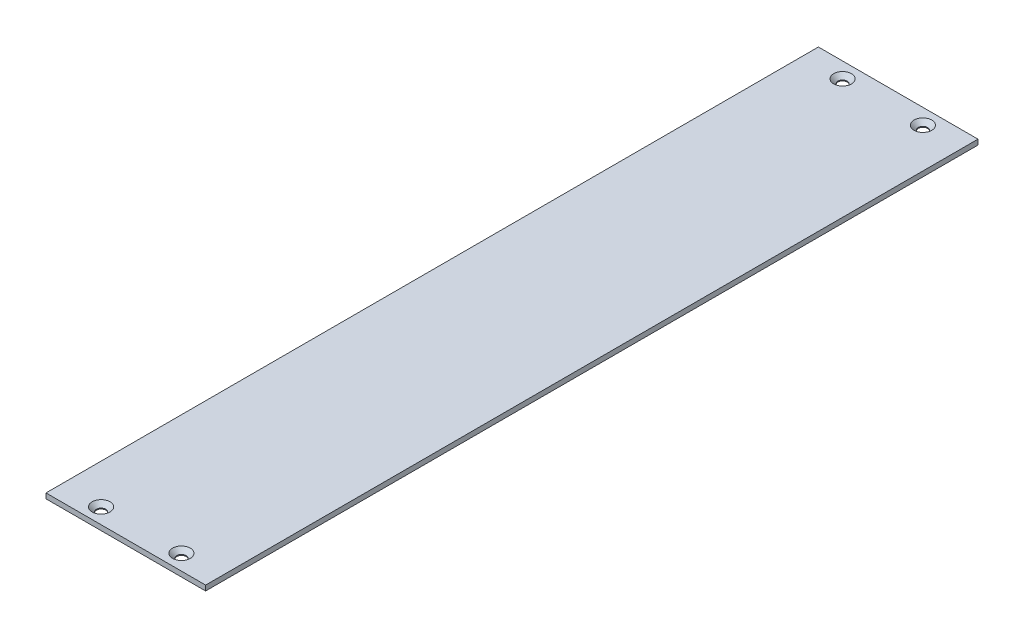
ISO-10303-21;
HEADER;
FILE_DESCRIPTION(('STEP AP214'),'2;1');
FILE_NAME('part.step','',(''),(''),'','','');
FILE_SCHEMA(('AUTOMOTIVE_DESIGN { 1 0 10303 214 1 1 1 1 }'));
ENDSEC;
DATA;
#1=APPLICATION_CONTEXT('core data for automotive mechanical design processes');
#2=APPLICATION_PROTOCOL_DEFINITION('international standard','automotive_design',2000,#1);
#3=PRODUCT_CONTEXT('',#1,'mechanical');
#4=PRODUCT('Part','Part','',(#3));
#5=PRODUCT_RELATED_PRODUCT_CATEGORY('part','',(#4));
#6=PRODUCT_DEFINITION_FORMATION('','',#4);
#7=PRODUCT_DEFINITION_CONTEXT('part definition',#1,'design');
#8=PRODUCT_DEFINITION('design','',#6,#7);
#9=PRODUCT_DEFINITION_SHAPE('','',#8);
#10=(LENGTH_UNIT() NAMED_UNIT(*) SI_UNIT(.MILLI.,.METRE.));
#11=(NAMED_UNIT(*) PLANE_ANGLE_UNIT() SI_UNIT($,.RADIAN.));
#12=(NAMED_UNIT(*) SI_UNIT($,.STERADIAN.) SOLID_ANGLE_UNIT());
#13=UNCERTAINTY_MEASURE_WITH_UNIT(LENGTH_MEASURE(1.E-05),#10,'distance_accuracy_value','');
#14=(GEOMETRIC_REPRESENTATION_CONTEXT(3) GLOBAL_UNCERTAINTY_ASSIGNED_CONTEXT((#13)) GLOBAL_UNIT_ASSIGNED_CONTEXT((#10,
#11,#12)) REPRESENTATION_CONTEXT('',''));
#15=CARTESIAN_POINT('',(0.,0.,0.));
#16=DIRECTION('',(0.,0.,1.));
#17=DIRECTION('',(1.,0.,0.));
#18=AXIS2_PLACEMENT_3D('',#15,#16,#17);
#19=CARTESIAN_POINT('',(0.,5.,0.));
#20=DIRECTION('',(1.,0.,0.));
#21=DIRECTION('',(0.,0.,-1.));
#22=AXIS2_PLACEMENT_3D('',#19,#20,#21);
#23=PLANE('',#22);
#24=DIRECTION('',(0.,0.,1.));
#25=VECTOR('',#24,1.);
#26=CARTESIAN_POINT('',(0.,0.,0.));
#27=LINE('',#26,#25);
#28=CARTESIAN_POINT('',(0.,0.,0.));
#29=VERTEX_POINT('',#28);
#30=CARTESIAN_POINT('',(0.,0.,750.));
#31=VERTEX_POINT('',#30);
#32=EDGE_CURVE('E96',#29,#31,#27,.T.);
#33=ORIENTED_EDGE('',*,*,#32,.T.);
#34=DIRECTION('',(0.,-1.,0.));
#35=VECTOR('',#34,1.);
#36=CARTESIAN_POINT('',(0.,5.,750.));
#37=LINE('',#36,#35);
#38=CARTESIAN_POINT('',(0.,5.,750.));
#39=VERTEX_POINT('',#38);
#40=EDGE_CURVE('E11',#39,#31,#37,.T.);
#41=ORIENTED_EDGE('',*,*,#40,.F.);
#42=DIRECTION('',(0.,0.,1.));
#43=VECTOR('',#42,1.);
#44=CARTESIAN_POINT('',(0.,5.,0.));
#45=LINE('',#44,#43);
#46=CARTESIAN_POINT('',(0.,5.,0.));
#47=VERTEX_POINT('',#46);
#48=EDGE_CURVE('E84',#47,#39,#45,.T.);
#49=ORIENTED_EDGE('',*,*,#48,.F.);
#50=DIRECTION('',(0.,-1.,0.));
#51=VECTOR('',#50,1.);
#52=CARTESIAN_POINT('',(0.,5.,0.));
#53=LINE('',#52,#51);
#54=EDGE_CURVE('E92',#47,#29,#53,.T.);
#55=ORIENTED_EDGE('',*,*,#54,.T.);
#56=EDGE_LOOP('',(#33,#41,#49,#55));
#57=FACE_BOUND('',#56,.T.);
#58=ADVANCED_FACE('F33',(#57),#23,.F.);
#59=CARTESIAN_POINT('',(0.,5.,750.));
#60=DIRECTION('',(0.,0.,-1.));
#61=DIRECTION('',(-1.,0.,0.));
#62=AXIS2_PLACEMENT_3D('',#59,#60,#61);
#63=PLANE('',#62);
#64=DIRECTION('',(1.,0.,0.));
#65=VECTOR('',#64,1.);
#66=CARTESIAN_POINT('',(0.,0.,750.));
#67=LINE('',#66,#65);
#68=CARTESIAN_POINT('',(155.,0.,750.));
#69=VERTEX_POINT('',#68);
#70=EDGE_CURVE('E88',#31,#69,#67,.T.);
#71=ORIENTED_EDGE('',*,*,#70,.T.);
#72=DIRECTION('',(0.,-1.,0.));
#73=VECTOR('',#72,1.);
#74=CARTESIAN_POINT('',(155.,5.,750.));
#75=LINE('',#74,#73);
#76=CARTESIAN_POINT('',(155.,5.,750.));
#77=VERTEX_POINT('',#76);
#78=EDGE_CURVE('E41',#77,#69,#75,.T.);
#79=ORIENTED_EDGE('',*,*,#78,.F.);
#80=DIRECTION('',(1.,0.,0.));
#81=VECTOR('',#80,1.);
#82=CARTESIAN_POINT('',(0.,5.,750.));
#83=LINE('',#82,#81);
#84=EDGE_CURVE('E79',#39,#77,#83,.T.);
#85=ORIENTED_EDGE('',*,*,#84,.F.);
#86=ORIENTED_EDGE('',*,*,#40,.T.);
#87=EDGE_LOOP('',(#71,#79,#85,#86));
#88=FACE_BOUND('',#87,.T.);
#89=ADVANCED_FACE('F87',(#88),#63,.F.);
#90=CARTESIAN_POINT('',(155.,5.,0.));
#91=DIRECTION('',(-1.,0.,0.));
#92=DIRECTION('',(0.,0.,1.));
#93=AXIS2_PLACEMENT_3D('',#90,#91,#92);
#94=PLANE('',#93);
#95=DIRECTION('',(0.,0.,-1.));
#96=VECTOR('',#95,1.);
#97=CARTESIAN_POINT('',(155.,0.,0.));
#98=LINE('',#97,#96);
#99=CARTESIAN_POINT('',(155.,0.,0.));
#100=VERTEX_POINT('',#99);
#101=EDGE_CURVE('E66',#69,#100,#98,.T.);
#102=ORIENTED_EDGE('',*,*,#101,.T.);
#103=DIRECTION('',(0.,-1.,0.));
#104=VECTOR('',#103,1.);
#105=CARTESIAN_POINT('',(155.,5.,0.));
#106=LINE('',#105,#104);
#107=CARTESIAN_POINT('',(155.,5.,0.));
#108=VERTEX_POINT('',#107);
#109=EDGE_CURVE('E89',#108,#100,#106,.T.);
#110=ORIENTED_EDGE('',*,*,#109,.F.);
#111=DIRECTION('',(0.,0.,-1.));
#112=VECTOR('',#111,1.);
#113=CARTESIAN_POINT('',(155.,5.,0.));
#114=LINE('',#113,#112);
#115=EDGE_CURVE('E82',#77,#108,#114,.T.);
#116=ORIENTED_EDGE('',*,*,#115,.F.);
#117=ORIENTED_EDGE('',*,*,#78,.T.);
#118=EDGE_LOOP('',(#102,#110,#116,#117));
#119=FACE_BOUND('',#118,.T.);
#120=ADVANCED_FACE('F90',(#119),#94,.F.);
#121=CARTESIAN_POINT('',(0.,5.,0.));
#122=DIRECTION('',(0.,0.,1.));
#123=DIRECTION('',(1.,0.,0.));
#124=AXIS2_PLACEMENT_3D('',#121,#122,#123);
#125=PLANE('',#124);
#126=DIRECTION('',(-1.,0.,0.));
#127=VECTOR('',#126,1.);
#128=CARTESIAN_POINT('',(0.,0.,0.));
#129=LINE('',#128,#127);
#130=EDGE_CURVE('E72',#100,#29,#129,.T.);
#131=ORIENTED_EDGE('',*,*,#130,.T.);
#132=ORIENTED_EDGE('',*,*,#54,.F.);
#133=DIRECTION('',(-1.,0.,0.));
#134=VECTOR('',#133,1.);
#135=CARTESIAN_POINT('',(0.,5.,0.));
#136=LINE('',#135,#134);
#137=EDGE_CURVE('E49',#108,#47,#136,.T.);
#138=ORIENTED_EDGE('',*,*,#137,.F.);
#139=ORIENTED_EDGE('',*,*,#109,.T.);
#140=EDGE_LOOP('',(#131,#132,#138,#139));
#141=FACE_BOUND('',#140,.T.);
#142=ADVANCED_FACE('F104',(#141),#125,.F.);
#143=CARTESIAN_POINT('',(0.,5.,0.));
#144=DIRECTION('',(0.,1.,0.));
#145=DIRECTION('',(0.,0.,1.));
#146=AXIS2_PLACEMENT_3D('',#143,#144,#145);
#147=PLANE('',#146);
#148=CARTESIAN_POINT('',(38.5,5.,735.));
#149=DIRECTION('',(0.,1.,0.));
#150=DIRECTION('',(0.,0.,1.));
#151=AXIS2_PLACEMENT_3D('',#148,#149,#150);
#152=CIRCLE('',#151,8.65);
#153=CARTESIAN_POINT('',(38.5,5.,743.65));
#154=VERTEX_POINT('',#153);
#155=EDGE_CURVE('E142',#154,#154,#152,.T.);
#156=ORIENTED_EDGE('',*,*,#155,.F.);
#157=EDGE_LOOP('',(#156));
#158=FACE_BOUND('',#157,.T.);
#159=CARTESIAN_POINT('',(38.5,5.,15.));
#160=DIRECTION('',(0.,1.,0.));
#161=DIRECTION('',(0.,0.,1.));
#162=AXIS2_PLACEMENT_3D('',#159,#160,#161);
#163=CIRCLE('',#162,8.65);
#164=CARTESIAN_POINT('',(38.5,5.,23.65));
#165=VERTEX_POINT('',#164);
#166=EDGE_CURVE('E133',#165,#165,#163,.T.);
#167=ORIENTED_EDGE('',*,*,#166,.F.);
#168=EDGE_LOOP('',(#167));
#169=FACE_BOUND('',#168,.T.);
#170=CARTESIAN_POINT('',(116.5,5.,735.));
#171=DIRECTION('',(0.,1.,0.));
#172=DIRECTION('',(0.,0.,1.));
#173=AXIS2_PLACEMENT_3D('',#170,#171,#172);
#174=CIRCLE('',#173,8.64999999999999);
#175=CARTESIAN_POINT('',(116.5,5.,743.65));
#176=VERTEX_POINT('',#175);
#177=EDGE_CURVE('E124',#176,#176,#174,.T.);
#178=ORIENTED_EDGE('',*,*,#177,.F.);
#179=EDGE_LOOP('',(#178));
#180=FACE_BOUND('',#179,.T.);
#181=CARTESIAN_POINT('',(116.5,5.,15.));
#182=DIRECTION('',(0.,1.,0.));
#183=DIRECTION('',(0.,0.,1.));
#184=AXIS2_PLACEMENT_3D('',#181,#182,#183);
#185=CIRCLE('',#184,8.64999999999999);
#186=CARTESIAN_POINT('',(116.5,5.,23.65));
#187=VERTEX_POINT('',#186);
#188=EDGE_CURVE('E115',#187,#187,#185,.T.);
#189=ORIENTED_EDGE('',*,*,#188,.F.);
#190=EDGE_LOOP('',(#189));
#191=FACE_BOUND('',#190,.T.);
#192=ORIENTED_EDGE('',*,*,#48,.T.);
#193=ORIENTED_EDGE('',*,*,#84,.T.);
#194=ORIENTED_EDGE('',*,*,#115,.T.);
#195=ORIENTED_EDGE('',*,*,#137,.T.);
#196=EDGE_LOOP('',(#192,#193,#194,#195));
#197=FACE_BOUND('',#196,.T.);
#198=ADVANCED_FACE('F80',(#158,#169,#180,#191,#197),#147,.T.);
#199=CARTESIAN_POINT('',(0.,0.,0.));
#200=DIRECTION('',(0.,1.,0.));
#201=DIRECTION('',(0.,0.,1.));
#202=AXIS2_PLACEMENT_3D('',#199,#200,#201);
#203=PLANE('',#202);
#204=CARTESIAN_POINT('',(38.5,0.,735.));
#205=DIRECTION('',(0.,1.,0.));
#206=DIRECTION('',(0.,0.,1.));
#207=AXIS2_PLACEMENT_3D('',#204,#205,#206);
#208=CIRCLE('',#207,4.5);
#209=CARTESIAN_POINT('',(38.5,0.,739.5));
#210=VERTEX_POINT('',#209);
#211=EDGE_CURVE('E136',#210,#210,#208,.T.);
#212=ORIENTED_EDGE('',*,*,#211,.T.);
#213=EDGE_LOOP('',(#212));
#214=FACE_BOUND('',#213,.T.);
#215=CARTESIAN_POINT('',(38.5,0.,15.));
#216=DIRECTION('',(0.,1.,0.));
#217=DIRECTION('',(0.,0.,1.));
#218=AXIS2_PLACEMENT_3D('',#215,#216,#217);
#219=CIRCLE('',#218,4.5);
#220=CARTESIAN_POINT('',(38.5,0.,19.5));
#221=VERTEX_POINT('',#220);
#222=EDGE_CURVE('E127',#221,#221,#219,.T.);
#223=ORIENTED_EDGE('',*,*,#222,.T.);
#224=EDGE_LOOP('',(#223));
#225=FACE_BOUND('',#224,.T.);
#226=CARTESIAN_POINT('',(116.5,0.,735.));
#227=DIRECTION('',(0.,1.,0.));
#228=DIRECTION('',(0.,0.,1.));
#229=AXIS2_PLACEMENT_3D('',#226,#227,#228);
#230=CIRCLE('',#229,4.5);
#231=CARTESIAN_POINT('',(116.5,0.,739.5));
#232=VERTEX_POINT('',#231);
#233=EDGE_CURVE('E118',#232,#232,#230,.T.);
#234=ORIENTED_EDGE('',*,*,#233,.T.);
#235=EDGE_LOOP('',(#234));
#236=FACE_BOUND('',#235,.T.);
#237=CARTESIAN_POINT('',(116.5,0.,15.));
#238=DIRECTION('',(0.,1.,0.));
#239=DIRECTION('',(0.,0.,1.));
#240=AXIS2_PLACEMENT_3D('',#237,#238,#239);
#241=CIRCLE('',#240,4.5);
#242=CARTESIAN_POINT('',(116.5,0.,19.5));
#243=VERTEX_POINT('',#242);
#244=EDGE_CURVE('E99',#243,#243,#241,.T.);
#245=ORIENTED_EDGE('',*,*,#244,.T.);
#246=EDGE_LOOP('',(#245));
#247=FACE_BOUND('',#246,.T.);
#248=ORIENTED_EDGE('',*,*,#32,.F.);
#249=ORIENTED_EDGE('',*,*,#130,.F.);
#250=ORIENTED_EDGE('',*,*,#101,.F.);
#251=ORIENTED_EDGE('',*,*,#70,.F.);
#252=EDGE_LOOP('',(#248,#249,#250,#251));
#253=FACE_BOUND('',#252,.T.);
#254=ADVANCED_FACE('F107',(#214,#225,#236,#247,#253),#203,.F.);
#255=CARTESIAN_POINT('',(116.5,5.,15.));
#256=DIRECTION('',(0.,1.,0.));
#257=DIRECTION('',(0.,0.,1.));
#258=AXIS2_PLACEMENT_3D('',#255,#256,#257);
#259=CYLINDRICAL_SURFACE('',#258,4.5);
#260=ORIENTED_EDGE('',*,*,#244,.F.);
#261=EDGE_LOOP('',(#260));
#262=FACE_BOUND('',#261,.T.);
#263=CARTESIAN_POINT('',(116.5,0.850000000000007,15.));
#264=DIRECTION('',(0.,1.,0.));
#265=DIRECTION('',(0.,0.,1.));
#266=AXIS2_PLACEMENT_3D('',#263,#264,#265);
#267=CIRCLE('',#266,4.5);
#268=CARTESIAN_POINT('',(116.5,0.850000000000007,19.5));
#269=VERTEX_POINT('',#268);
#270=EDGE_CURVE('E112',#269,#269,#267,.T.);
#271=ORIENTED_EDGE('',*,*,#270,.T.);
#272=EDGE_LOOP('',(#271));
#273=FACE_BOUND('',#272,.T.);
#274=ADVANCED_FACE('F160',(#262,#273),#259,.F.);
#275=CARTESIAN_POINT('',(116.5,5.,15.));
#276=DIRECTION('',(0.,1.,0.));
#277=DIRECTION('',(0.,0.,1.));
#278=AXIS2_PLACEMENT_3D('',#275,#276,#277);
#279=CONICAL_SURFACE('',#278,8.64999999999999,0.785398163397448);
#280=ORIENTED_EDGE('',*,*,#270,.F.);
#281=EDGE_LOOP('',(#280));
#282=FACE_BOUND('',#281,.T.);
#283=ORIENTED_EDGE('',*,*,#188,.T.);
#284=EDGE_LOOP('',(#283));
#285=FACE_BOUND('',#284,.T.);
#286=ADVANCED_FACE('F157',(#282,#285),#279,.F.);
#287=CARTESIAN_POINT('',(116.5,5.,735.));
#288=DIRECTION('',(0.,1.,0.));
#289=DIRECTION('',(0.,0.,1.));
#290=AXIS2_PLACEMENT_3D('',#287,#288,#289);
#291=CYLINDRICAL_SURFACE('',#290,4.5);
#292=ORIENTED_EDGE('',*,*,#233,.F.);
#293=EDGE_LOOP('',(#292));
#294=FACE_BOUND('',#293,.T.);
#295=CARTESIAN_POINT('',(116.5,0.850000000000007,735.));
#296=DIRECTION('',(0.,1.,0.));
#297=DIRECTION('',(0.,0.,1.));
#298=AXIS2_PLACEMENT_3D('',#295,#296,#297);
#299=CIRCLE('',#298,4.5);
#300=CARTESIAN_POINT('',(116.5,0.850000000000007,739.5));
#301=VERTEX_POINT('',#300);
#302=EDGE_CURVE('E121',#301,#301,#299,.T.);
#303=ORIENTED_EDGE('',*,*,#302,.T.);
#304=EDGE_LOOP('',(#303));
#305=FACE_BOUND('',#304,.T.);
#306=ADVANCED_FACE('F159',(#294,#305),#291,.F.);
#307=CARTESIAN_POINT('',(116.5,5.,735.));
#308=DIRECTION('',(0.,1.,0.));
#309=DIRECTION('',(0.,0.,1.));
#310=AXIS2_PLACEMENT_3D('',#307,#308,#309);
#311=CONICAL_SURFACE('',#310,8.64999999999999,0.785398163397448);
#312=ORIENTED_EDGE('',*,*,#302,.F.);
#313=EDGE_LOOP('',(#312));
#314=FACE_BOUND('',#313,.T.);
#315=ORIENTED_EDGE('',*,*,#177,.T.);
#316=EDGE_LOOP('',(#315));
#317=FACE_BOUND('',#316,.T.);
#318=ADVANCED_FACE('F167',(#314,#317),#311,.F.);
#319=CARTESIAN_POINT('',(38.5,5.,15.));
#320=DIRECTION('',(0.,1.,0.));
#321=DIRECTION('',(0.,0.,1.));
#322=AXIS2_PLACEMENT_3D('',#319,#320,#321);
#323=CYLINDRICAL_SURFACE('',#322,4.5);
#324=ORIENTED_EDGE('',*,*,#222,.F.);
#325=EDGE_LOOP('',(#324));
#326=FACE_BOUND('',#325,.T.);
#327=CARTESIAN_POINT('',(38.5,0.850000000000007,15.));
#328=DIRECTION('',(0.,1.,0.));
#329=DIRECTION('',(0.,0.,1.));
#330=AXIS2_PLACEMENT_3D('',#327,#328,#329);
#331=CIRCLE('',#330,4.5);
#332=CARTESIAN_POINT('',(38.5,0.850000000000007,19.5));
#333=VERTEX_POINT('',#332);
#334=EDGE_CURVE('E130',#333,#333,#331,.T.);
#335=ORIENTED_EDGE('',*,*,#334,.T.);
#336=EDGE_LOOP('',(#335));
#337=FACE_BOUND('',#336,.T.);
#338=ADVANCED_FACE('F201',(#326,#337),#323,.F.);
#339=CARTESIAN_POINT('',(38.5,5.,15.));
#340=DIRECTION('',(0.,1.,0.));
#341=DIRECTION('',(0.,0.,1.));
#342=AXIS2_PLACEMENT_3D('',#339,#340,#341);
#343=CONICAL_SURFACE('',#342,8.65,0.785398163397449);
#344=ORIENTED_EDGE('',*,*,#334,.F.);
#345=EDGE_LOOP('',(#344));
#346=FACE_BOUND('',#345,.T.);
#347=ORIENTED_EDGE('',*,*,#166,.T.);
#348=EDGE_LOOP('',(#347));
#349=FACE_BOUND('',#348,.T.);
#350=ADVANCED_FACE('F206',(#346,#349),#343,.F.);
#351=CARTESIAN_POINT('',(38.5,5.,735.));
#352=DIRECTION('',(0.,1.,0.));
#353=DIRECTION('',(0.,0.,1.));
#354=AXIS2_PLACEMENT_3D('',#351,#352,#353);
#355=CYLINDRICAL_SURFACE('',#354,4.5);
#356=ORIENTED_EDGE('',*,*,#211,.F.);
#357=EDGE_LOOP('',(#356));
#358=FACE_BOUND('',#357,.T.);
#359=CARTESIAN_POINT('',(38.5,0.850000000000007,735.));
#360=DIRECTION('',(0.,1.,0.));
#361=DIRECTION('',(0.,0.,1.));
#362=AXIS2_PLACEMENT_3D('',#359,#360,#361);
#363=CIRCLE('',#362,4.5);
#364=CARTESIAN_POINT('',(38.5,0.850000000000007,739.5));
#365=VERTEX_POINT('',#364);
#366=EDGE_CURVE('E139',#365,#365,#363,.T.);
#367=ORIENTED_EDGE('',*,*,#366,.T.);
#368=EDGE_LOOP('',(#367));
#369=FACE_BOUND('',#368,.T.);
#370=ADVANCED_FACE('F212',(#358,#369),#355,.F.);
#371=CARTESIAN_POINT('',(38.5,5.,735.));
#372=DIRECTION('',(0.,1.,0.));
#373=DIRECTION('',(0.,0.,1.));
#374=AXIS2_PLACEMENT_3D('',#371,#372,#373);
#375=CONICAL_SURFACE('',#374,8.65,0.785398163397449);
#376=ORIENTED_EDGE('',*,*,#366,.F.);
#377=EDGE_LOOP('',(#376));
#378=FACE_BOUND('',#377,.T.);
#379=ORIENTED_EDGE('',*,*,#155,.T.);
#380=EDGE_LOOP('',(#379));
#381=FACE_BOUND('',#380,.T.);
#382=ADVANCED_FACE('F146',(#378,#381),#375,.F.);
#383=CLOSED_SHELL('',(#58,#89,#120,#142,#198,#254,#274,#286,#306,#318,#338,#350,#370,#382));
#384=MANIFOLD_SOLID_BREP('B2',#383);
#385=ADVANCED_BREP_SHAPE_REPRESENTATION('',(#18,#384),#14);
#386=SHAPE_DEFINITION_REPRESENTATION(#9,#385);
ENDSEC;
END-ISO-10303-21;
